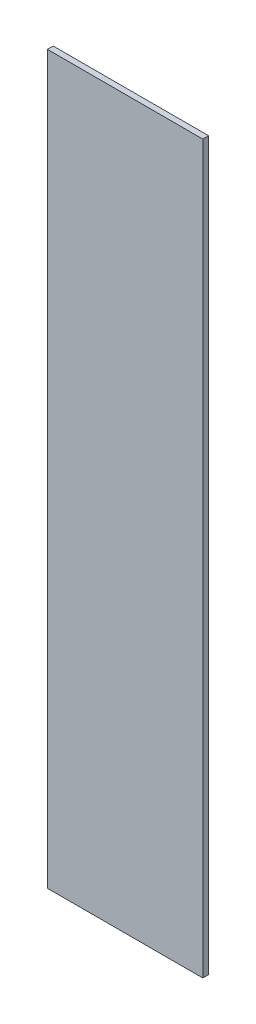
ISO-10303-21;
HEADER;
FILE_DESCRIPTION(('STEP AP214'),'2;1');
FILE_NAME('part.step','',(''),(''),'','','');
FILE_SCHEMA(('AUTOMOTIVE_DESIGN { 1 0 10303 214 1 1 1 1 }'));
ENDSEC;
DATA;
#1=APPLICATION_CONTEXT('core data for automotive mechanical design processes');
#2=APPLICATION_PROTOCOL_DEFINITION('international standard','automotive_design',2000,#1);
#3=PRODUCT_CONTEXT('',#1,'mechanical');
#4=PRODUCT('Part','Part','',(#3));
#5=PRODUCT_RELATED_PRODUCT_CATEGORY('part','',(#4));
#6=PRODUCT_DEFINITION_FORMATION('','',#4);
#7=PRODUCT_DEFINITION_CONTEXT('part definition',#1,'design');
#8=PRODUCT_DEFINITION('design','',#6,#7);
#9=PRODUCT_DEFINITION_SHAPE('','',#8);
#10=(LENGTH_UNIT() NAMED_UNIT(*) SI_UNIT(.MILLI.,.METRE.));
#11=(NAMED_UNIT(*) PLANE_ANGLE_UNIT() SI_UNIT($,.RADIAN.));
#12=(NAMED_UNIT(*) SI_UNIT($,.STERADIAN.) SOLID_ANGLE_UNIT());
#13=UNCERTAINTY_MEASURE_WITH_UNIT(LENGTH_MEASURE(1.E-05),#10,'distance_accuracy_value','');
#14=(GEOMETRIC_REPRESENTATION_CONTEXT(3) GLOBAL_UNCERTAINTY_ASSIGNED_CONTEXT((#13)) GLOBAL_UNIT_ASSIGNED_CONTEXT((#10,
#11,#12)) REPRESENTATION_CONTEXT('',''));
#15=CARTESIAN_POINT('',(0.,0.,0.));
#16=DIRECTION('',(0.,0.,1.));
#17=DIRECTION('',(1.,0.,0.));
#18=AXIS2_PLACEMENT_3D('',#15,#16,#17);
#19=CARTESIAN_POINT('',(-0.4261414059901,-0.00349896598354401,0.00086146168299));
#20=DIRECTION('',(0.,1.,0.));
#21=DIRECTION('',(0.,0.,1.));
#22=AXIS2_PLACEMENT_3D('',#19,#20,#21);
#23=PLANE('',#22);
#24=DIRECTION('',(0.,0.,1.));
#25=VECTOR('',#24,1.);
#26=CARTESIAN_POINT('',(-0.4422456829209,-0.00349896598354401,-0.00033853831701));
#27=LINE('',#26,#25);
#28=CARTESIAN_POINT('',(-0.4422456829209,-0.00349896598354401,-0.00033853831701));
#29=VERTEX_POINT('',#28);
#30=CARTESIAN_POINT('',(-0.4422456829209,-0.00349896598354401,0.00086146168299));
#31=VERTEX_POINT('',#30);
#32=EDGE_CURVE('E11',#29,#31,#27,.T.);
#33=ORIENTED_EDGE('',*,*,#32,.T.);
#34=DIRECTION('',(1.,0.,0.));
#35=VECTOR('',#34,1.);
#36=CARTESIAN_POINT('',(-0.4422456829209,-0.00349896598354401,0.00086146168299));
#37=LINE('',#36,#35);
#38=CARTESIAN_POINT('',(-0.4100371290593,-0.00349896598354401,0.00086146168299));
#39=VERTEX_POINT('',#38);
#40=EDGE_CURVE('E24',#31,#39,#37,.T.);
#41=ORIENTED_EDGE('',*,*,#40,.T.);
#42=DIRECTION('',(0.,0.,1.));
#43=VECTOR('',#42,1.);
#44=CARTESIAN_POINT('',(-0.4100371290593,-0.00349896598354401,-0.00033853831701));
#45=LINE('',#44,#43);
#46=CARTESIAN_POINT('',(-0.4100371290593,-0.00349896598354401,-0.00033853831701));
#47=VERTEX_POINT('',#46);
#48=EDGE_CURVE('E85',#47,#39,#45,.T.);
#49=ORIENTED_EDGE('',*,*,#48,.F.);
#50=DIRECTION('',(1.,0.,0.));
#51=VECTOR('',#50,1.);
#52=CARTESIAN_POINT('',(-0.4422456829209,-0.00349896598354401,-0.00033853831701));
#53=LINE('',#52,#51);
#54=EDGE_CURVE('E83',#29,#47,#53,.T.);
#55=ORIENTED_EDGE('',*,*,#54,.F.);
#56=EDGE_LOOP('',(#33,#41,#49,#55));
#57=FACE_BOUND('',#56,.T.);
#58=ADVANCED_FACE('F17',(#57),#23,.T.);
#59=CARTESIAN_POINT('',(-0.4100371290593,-0.078781583834872,0.00086146168299));
#60=DIRECTION('',(1.,0.,0.));
#61=DIRECTION('',(0.,0.,-1.));
#62=AXIS2_PLACEMENT_3D('',#59,#60,#61);
#63=PLANE('',#62);
#64=ORIENTED_EDGE('',*,*,#48,.T.);
#65=DIRECTION('',(0.,-1.,0.));
#66=VECTOR('',#65,1.);
#67=CARTESIAN_POINT('',(-0.4100371290593,-0.00349896598354401,0.00086146168299));
#68=LINE('',#67,#66);
#69=CARTESIAN_POINT('',(-0.4100371290593,-0.1540642016862,0.00086146168299));
#70=VERTEX_POINT('',#69);
#71=EDGE_CURVE('E81',#39,#70,#68,.T.);
#72=ORIENTED_EDGE('',*,*,#71,.T.);
#73=DIRECTION('',(0.,0.,1.));
#74=VECTOR('',#73,1.);
#75=CARTESIAN_POINT('',(-0.4100371290593,-0.1540642016862,-0.00033853831701));
#76=LINE('',#75,#74);
#77=CARTESIAN_POINT('',(-0.4100371290593,-0.1540642016862,-0.00033853831701));
#78=VERTEX_POINT('',#77);
#79=EDGE_CURVE('E79',#78,#70,#76,.T.);
#80=ORIENTED_EDGE('',*,*,#79,.F.);
#81=DIRECTION('',(0.,-1.,0.));
#82=VECTOR('',#81,1.);
#83=CARTESIAN_POINT('',(-0.4100371290593,-0.00349896598354401,-0.00033853831701));
#84=LINE('',#83,#82);
#85=EDGE_CURVE('E70',#47,#78,#84,.T.);
#86=ORIENTED_EDGE('',*,*,#85,.F.);
#87=EDGE_LOOP('',(#64,#72,#80,#86));
#88=FACE_BOUND('',#87,.T.);
#89=ADVANCED_FACE('F90',(#88),#63,.T.);
#90=CARTESIAN_POINT('',(-0.4261414059901,-0.1540642016862,0.00086146168299));
#91=DIRECTION('',(0.,-1.,0.));
#92=DIRECTION('',(0.,0.,-1.));
#93=AXIS2_PLACEMENT_3D('',#90,#91,#92);
#94=PLANE('',#93);
#95=ORIENTED_EDGE('',*,*,#79,.T.);
#96=DIRECTION('',(-1.,0.,0.));
#97=VECTOR('',#96,1.);
#98=CARTESIAN_POINT('',(-0.4100371290593,-0.1540642016862,0.00086146168299));
#99=LINE('',#98,#97);
#100=CARTESIAN_POINT('',(-0.4422456829209,-0.1540642016862,0.00086146168299));
#101=VERTEX_POINT('',#100);
#102=EDGE_CURVE('E60',#70,#101,#99,.T.);
#103=ORIENTED_EDGE('',*,*,#102,.T.);
#104=DIRECTION('',(0.,0.,1.));
#105=VECTOR('',#104,1.);
#106=CARTESIAN_POINT('',(-0.4422456829209,-0.1540642016862,-0.00033853831701));
#107=LINE('',#106,#105);
#108=CARTESIAN_POINT('',(-0.4422456829209,-0.1540642016862,-0.00033853831701));
#109=VERTEX_POINT('',#108);
#110=EDGE_CURVE('E54',#109,#101,#107,.T.);
#111=ORIENTED_EDGE('',*,*,#110,.F.);
#112=DIRECTION('',(-1.,0.,0.));
#113=VECTOR('',#112,1.);
#114=CARTESIAN_POINT('',(-0.4100371290593,-0.1540642016862,-0.00033853831701));
#115=LINE('',#114,#113);
#116=EDGE_CURVE('E58',#78,#109,#115,.T.);
#117=ORIENTED_EDGE('',*,*,#116,.F.);
#118=EDGE_LOOP('',(#95,#103,#111,#117));
#119=FACE_BOUND('',#118,.T.);
#120=ADVANCED_FACE('F57',(#119),#94,.T.);
#121=CARTESIAN_POINT('',(-0.4422456829209,-0.078781583834872,0.00086146168299));
#122=DIRECTION('',(-1.,0.,0.));
#123=DIRECTION('',(0.,0.,1.));
#124=AXIS2_PLACEMENT_3D('',#121,#122,#123);
#125=PLANE('',#124);
#126=ORIENTED_EDGE('',*,*,#110,.T.);
#127=DIRECTION('',(0.,1.,0.));
#128=VECTOR('',#127,1.);
#129=CARTESIAN_POINT('',(-0.4422456829209,-0.1540642016862,0.00086146168299));
#130=LINE('',#129,#128);
#131=EDGE_CURVE('E71',#101,#31,#130,.T.);
#132=ORIENTED_EDGE('',*,*,#131,.T.);
#133=ORIENTED_EDGE('',*,*,#32,.F.);
#134=DIRECTION('',(0.,1.,0.));
#135=VECTOR('',#134,1.);
#136=CARTESIAN_POINT('',(-0.4422456829209,-0.1540642016862,-0.00033853831701));
#137=LINE('',#136,#135);
#138=EDGE_CURVE('E68',#109,#29,#137,.T.);
#139=ORIENTED_EDGE('',*,*,#138,.F.);
#140=EDGE_LOOP('',(#126,#132,#133,#139));
#141=FACE_BOUND('',#140,.T.);
#142=ADVANCED_FACE('F73',(#141),#125,.T.);
#143=CARTESIAN_POINT('',(-0.4261414059901,-0.1540642016862,-0.00033853831701));
#144=DIRECTION('',(0.,0.,1.));
#145=DIRECTION('',(1.,0.,0.));
#146=AXIS2_PLACEMENT_3D('',#143,#144,#145);
#147=PLANE('',#146);
#148=ORIENTED_EDGE('',*,*,#54,.T.);
#149=ORIENTED_EDGE('',*,*,#85,.T.);
#150=ORIENTED_EDGE('',*,*,#116,.T.);
#151=ORIENTED_EDGE('',*,*,#138,.T.);
#152=EDGE_LOOP('',(#148,#149,#150,#151));
#153=FACE_BOUND('',#152,.T.);
#154=ADVANCED_FACE('F67',(#153),#147,.F.);
#155=CARTESIAN_POINT('',(-0.4261414059901,-0.1540642016862,0.00086146168299));
#156=DIRECTION('',(0.,0.,1.));
#157=DIRECTION('',(1.,0.,0.));
#158=AXIS2_PLACEMENT_3D('',#155,#156,#157);
#159=PLANE('',#158);
#160=ORIENTED_EDGE('',*,*,#40,.F.);
#161=ORIENTED_EDGE('',*,*,#131,.F.);
#162=ORIENTED_EDGE('',*,*,#102,.F.);
#163=ORIENTED_EDGE('',*,*,#71,.F.);
#164=EDGE_LOOP('',(#160,#161,#162,#163));
#165=FACE_BOUND('',#164,.T.);
#166=ADVANCED_FACE('F91',(#165),#159,.T.);
#167=CLOSED_SHELL('',(#58,#89,#120,#142,#154,#166));
#168=MANIFOLD_SOLID_BREP('B1',#167);
#169=ADVANCED_BREP_SHAPE_REPRESENTATION('',(#18,#168),#14);
#170=SHAPE_DEFINITION_REPRESENTATION(#9,#169);
ENDSEC;
END-ISO-10303-21;
